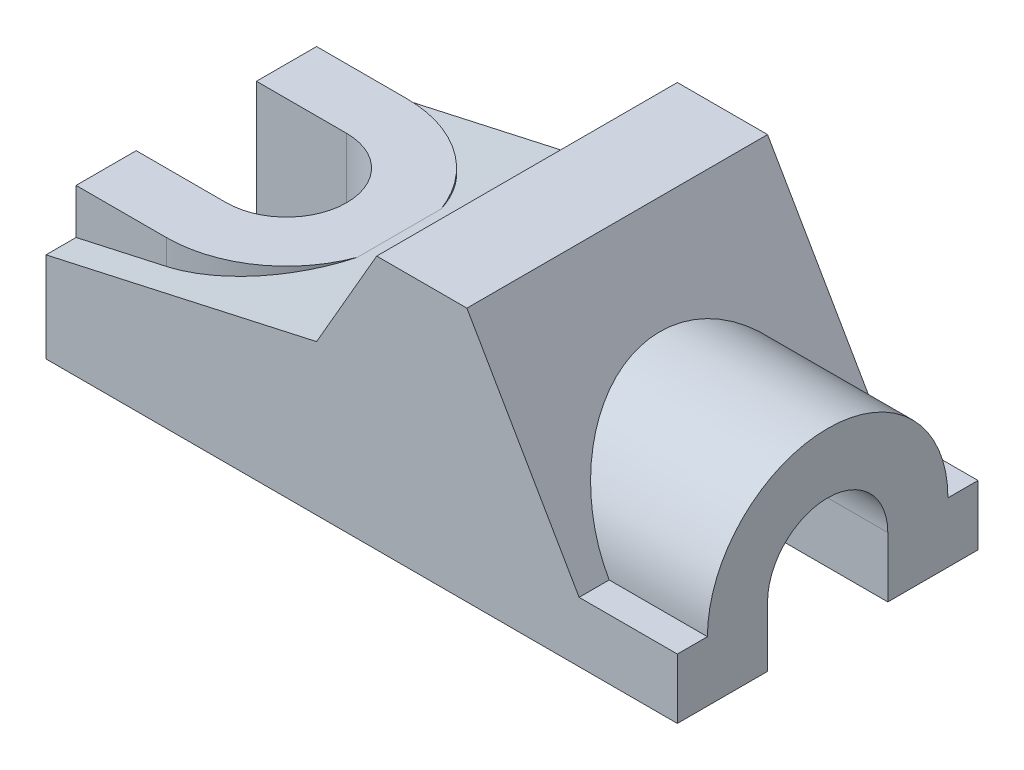
ISO-10303-21;
HEADER;
FILE_DESCRIPTION(('STEP AP214'),'2;1');
FILE_NAME('part.step','',(''),(''),'','','');
FILE_SCHEMA(('AUTOMOTIVE_DESIGN { 1 0 10303 214 1 1 1 1 }'));
ENDSEC;
DATA;
#1=APPLICATION_CONTEXT('core data for automotive mechanical design processes');
#2=APPLICATION_PROTOCOL_DEFINITION('international standard','automotive_design',2000,#1);
#3=PRODUCT_CONTEXT('',#1,'mechanical');
#4=PRODUCT('Part','Part','',(#3));
#5=PRODUCT_RELATED_PRODUCT_CATEGORY('part','',(#4));
#6=PRODUCT_DEFINITION_FORMATION('','',#4);
#7=PRODUCT_DEFINITION_CONTEXT('part definition',#1,'design');
#8=PRODUCT_DEFINITION('design','',#6,#7);
#9=PRODUCT_DEFINITION_SHAPE('','',#8);
#10=(LENGTH_UNIT() NAMED_UNIT(*) SI_UNIT(.MILLI.,.METRE.));
#11=(NAMED_UNIT(*) PLANE_ANGLE_UNIT() SI_UNIT($,.RADIAN.));
#12=(NAMED_UNIT(*) SI_UNIT($,.STERADIAN.) SOLID_ANGLE_UNIT());
#13=UNCERTAINTY_MEASURE_WITH_UNIT(LENGTH_MEASURE(1.E-05),#10,'distance_accuracy_value','');
#14=(GEOMETRIC_REPRESENTATION_CONTEXT(3) GLOBAL_UNCERTAINTY_ASSIGNED_CONTEXT((#13)) GLOBAL_UNIT_ASSIGNED_CONTEXT((#10,
#11,#12)) REPRESENTATION_CONTEXT('',''));
#15=CARTESIAN_POINT('',(0.,0.,0.));
#16=DIRECTION('',(0.,0.,1.));
#17=DIRECTION('',(1.,0.,0.));
#18=AXIS2_PLACEMENT_3D('',#15,#16,#17);
#19=CARTESIAN_POINT('',(0.,0.,31.75));
#20=DIRECTION('',(1.,0.,0.));
#21=DIRECTION('',(0.,0.,-1.));
#22=AXIS2_PLACEMENT_3D('',#19,#20,#21);
#23=PLANE('',#22);
#24=DIRECTION('',(0.,1.,0.));
#25=VECTOR('',#24,1.);
#26=CARTESIAN_POINT('',(0.,-44.3358461285371,12.7));
#27=LINE('',#26,#25);
#28=CARTESIAN_POINT('',(0.,0.,12.7));
#29=VERTEX_POINT('',#28);
#30=CARTESIAN_POINT('',(0.,28.575,12.7));
#31=VERTEX_POINT('',#30);
#32=EDGE_CURVE('E201',#29,#31,#27,.T.);
#33=ORIENTED_EDGE('',*,*,#32,.F.);
#34=DIRECTION('',(0.,0.,-1.));
#35=VECTOR('',#34,1.);
#36=CARTESIAN_POINT('',(0.,0.,31.75));
#37=LINE('',#36,#35);
#38=CARTESIAN_POINT('',(0.,0.,31.75));
#39=VERTEX_POINT('',#38);
#40=EDGE_CURVE('E11',#39,#29,#37,.T.);
#41=ORIENTED_EDGE('',*,*,#40,.F.);
#42=DIRECTION('',(0.,-1.,0.));
#43=VECTOR('',#42,1.);
#44=CARTESIAN_POINT('',(0.,0.,31.75));
#45=LINE('',#44,#43);
#46=CARTESIAN_POINT('',(0.,19.05,31.75));
#47=VERTEX_POINT('',#46);
#48=EDGE_CURVE('E298',#47,#39,#45,.T.);
#49=ORIENTED_EDGE('',*,*,#48,.F.);
#50=DIRECTION('',(0.,0.,-1.));
#51=VECTOR('',#50,1.);
#52=CARTESIAN_POINT('',(0.,19.05,31.75));
#53=LINE('',#52,#51);
#54=CARTESIAN_POINT('',(0.,19.05,25.4));
#55=VERTEX_POINT('',#54);
#56=EDGE_CURVE('E336',#47,#55,#53,.T.);
#57=ORIENTED_EDGE('',*,*,#56,.T.);
#58=DIRECTION('',(0.,1.,0.));
#59=VECTOR('',#58,1.);
#60=CARTESIAN_POINT('',(0.,-44.3358461285371,25.4));
#61=LINE('',#60,#59);
#62=CARTESIAN_POINT('',(0.,28.575,25.4));
#63=VERTEX_POINT('',#62);
#64=EDGE_CURVE('E229',#55,#63,#61,.T.);
#65=ORIENTED_EDGE('',*,*,#64,.T.);
#66=DIRECTION('',(0.,0.,-1.));
#67=VECTOR('',#66,1.);
#68=CARTESIAN_POINT('',(0.,28.575,0.));
#69=LINE('',#68,#67);
#70=EDGE_CURVE('E225',#63,#31,#69,.T.);
#71=ORIENTED_EDGE('',*,*,#70,.T.);
#72=EDGE_LOOP('',(#33,#41,#49,#57,#65,#71));
#73=FACE_BOUND('',#72,.T.);
#74=ADVANCED_FACE('F35',(#73),#23,.F.);
#75=CARTESIAN_POINT('',(0.,0.,31.75));
#76=DIRECTION('',(0.,1.,0.));
#77=DIRECTION('',(0.,0.,1.));
#78=AXIS2_PLACEMENT_3D('',#75,#76,#77);
#79=PLANE('',#78);
#80=DIRECTION('',(-1.,0.,0.));
#81=VECTOR('',#80,1.);
#82=CARTESIAN_POINT('',(0.,0.,12.7));
#83=LINE('',#82,#81);
#84=CARTESIAN_POINT('',(19.05,0.,12.7));
#85=VERTEX_POINT('',#84);
#86=EDGE_CURVE('E195',#85,#29,#83,.T.);
#87=ORIENTED_EDGE('',*,*,#86,.F.);
#88=CARTESIAN_POINT('',(19.05,0.,0.));
#89=DIRECTION('',(0.,-1.,0.));
#90=DIRECTION('',(0.,0.,-1.));
#91=AXIS2_PLACEMENT_3D('',#88,#89,#90);
#92=CIRCLE('',#91,12.7);
#93=CARTESIAN_POINT('',(19.05,0.,-12.7));
#94=VERTEX_POINT('',#93);
#95=EDGE_CURVE('E205',#94,#85,#92,.T.);
#96=ORIENTED_EDGE('',*,*,#95,.F.);
#97=DIRECTION('',(-1.,0.,0.));
#98=VECTOR('',#97,1.);
#99=CARTESIAN_POINT('',(0.,0.,-12.7));
#100=LINE('',#99,#98);
#101=CARTESIAN_POINT('',(0.,0.,-12.7));
#102=VERTEX_POINT('',#101);
#103=EDGE_CURVE('E212',#94,#102,#100,.T.);
#104=ORIENTED_EDGE('',*,*,#103,.T.);
#105=CARTESIAN_POINT('',(0.,0.,-31.75));
#106=VERTEX_POINT('',#105);
#107=EDGE_CURVE('E43',#102,#106,#37,.T.);
#108=ORIENTED_EDGE('',*,*,#107,.T.);
#109=DIRECTION('',(1.,0.,0.));
#110=VECTOR('',#109,1.);
#111=CARTESIAN_POINT('',(0.,0.,-31.75));
#112=LINE('',#111,#110);
#113=CARTESIAN_POINT('',(133.35,0.,-31.75));
#114=VERTEX_POINT('',#113);
#115=EDGE_CURVE('E319',#106,#114,#112,.T.);
#116=ORIENTED_EDGE('',*,*,#115,.T.);
#117=DIRECTION('',(0.,0.,-1.));
#118=VECTOR('',#117,1.);
#119=CARTESIAN_POINT('',(133.35,0.,31.75));
#120=LINE('',#119,#118);
#121=CARTESIAN_POINT('',(133.35,0.,-12.7));
#122=VERTEX_POINT('',#121);
#123=EDGE_CURVE('E354',#122,#114,#120,.T.);
#124=ORIENTED_EDGE('',*,*,#123,.F.);
#125=DIRECTION('',(1.,0.,0.));
#126=VECTOR('',#125,1.);
#127=CARTESIAN_POINT('',(79.375,0.,-12.7));
#128=LINE('',#127,#126);
#129=CARTESIAN_POINT('',(79.375,0.,-12.7));
#130=VERTEX_POINT('',#129);
#131=EDGE_CURVE('E270',#130,#122,#128,.T.);
#132=ORIENTED_EDGE('',*,*,#131,.F.);
#133=DIRECTION('',(0.,0.,-1.));
#134=VECTOR('',#133,1.);
#135=CARTESIAN_POINT('',(79.375,0.,0.));
#136=LINE('',#135,#134);
#137=CARTESIAN_POINT('',(79.375,0.,12.7));
#138=VERTEX_POINT('',#137);
#139=EDGE_CURVE('E258',#138,#130,#136,.T.);
#140=ORIENTED_EDGE('',*,*,#139,.F.);
#141=DIRECTION('',(1.,0.,0.));
#142=VECTOR('',#141,1.);
#143=CARTESIAN_POINT('',(79.375,0.,12.7));
#144=LINE('',#143,#142);
#145=CARTESIAN_POINT('',(133.35,0.,12.7));
#146=VERTEX_POINT('',#145);
#147=EDGE_CURVE('E274',#138,#146,#144,.T.);
#148=ORIENTED_EDGE('',*,*,#147,.T.);
#149=CARTESIAN_POINT('',(133.35,0.,31.75));
#150=VERTEX_POINT('',#149);
#151=EDGE_CURVE('E355',#150,#146,#120,.T.);
#152=ORIENTED_EDGE('',*,*,#151,.F.);
#153=DIRECTION('',(1.,0.,0.));
#154=VECTOR('',#153,1.);
#155=CARTESIAN_POINT('',(0.,0.,31.75));
#156=LINE('',#155,#154);
#157=EDGE_CURVE('E301',#39,#150,#156,.T.);
#158=ORIENTED_EDGE('',*,*,#157,.F.);
#159=ORIENTED_EDGE('',*,*,#40,.T.);
#160=EDGE_LOOP('',(#87,#96,#104,#108,#116,#124,#132,#140,#148,#152,#158,#159));
#161=FACE_BOUND('',#160,.T.);
#162=ADVANCED_FACE('F210',(#161),#79,.F.);
#163=CARTESIAN_POINT('',(0.,19.05,31.75));
#164=DIRECTION('',(0.216930457818656,-0.976187060183953,0.));
#165=DIRECTION('',(0.976187060183953,0.216930457818656,0.));
#166=AXIS2_PLACEMENT_3D('',#163,#164,#165);
#167=PLANE('',#166);
#168=DIRECTION('',(-0.976187060183953,-0.216930457818656,0.));
#169=VECTOR('',#168,1.);
#170=CARTESIAN_POINT('',(-13.4228850625137,16.0671366527747,25.4));
#171=LINE('',#170,#169);
#172=CARTESIAN_POINT('',(19.05,23.2833333333333,25.4));
#173=VERTEX_POINT('',#172);
#174=EDGE_CURVE('E239',#173,#55,#171,.T.);
#175=ORIENTED_EDGE('',*,*,#174,.T.);
#176=ORIENTED_EDGE('',*,*,#56,.F.);
#177=DIRECTION('',(-0.976187060183953,-0.216930457818656,0.));
#178=VECTOR('',#177,1.);
#179=CARTESIAN_POINT('',(0.,19.05,31.75));
#180=LINE('',#179,#178);
#181=CARTESIAN_POINT('',(57.15,31.75,31.75));
#182=VERTEX_POINT('',#181);
#183=EDGE_CURVE('E314',#182,#47,#180,.T.);
#184=ORIENTED_EDGE('',*,*,#183,.F.);
#185=DIRECTION('',(0.,0.,-1.));
#186=VECTOR('',#185,1.);
#187=CARTESIAN_POINT('',(57.15,31.75,31.75));
#188=LINE('',#187,#186);
#189=CARTESIAN_POINT('',(57.15,31.75,-31.75));
#190=VERTEX_POINT('',#189);
#191=EDGE_CURVE('E339',#182,#190,#188,.T.);
#192=ORIENTED_EDGE('',*,*,#191,.T.);
#193=DIRECTION('',(-0.976187060183953,-0.216930457818656,0.));
#194=VECTOR('',#193,1.);
#195=CARTESIAN_POINT('',(0.,19.05,-31.75));
#196=LINE('',#195,#194);
#197=CARTESIAN_POINT('',(0.,19.05,-31.75));
#198=VERTEX_POINT('',#197);
#199=EDGE_CURVE('E302',#190,#198,#196,.T.);
#200=ORIENTED_EDGE('',*,*,#199,.T.);
#201=CARTESIAN_POINT('',(0.,19.05,-25.4));
#202=VERTEX_POINT('',#201);
#203=EDGE_CURVE('E316',#202,#198,#53,.T.);
#204=ORIENTED_EDGE('',*,*,#203,.F.);
#205=DIRECTION('',(-0.976187060183953,-0.216930457818656,0.));
#206=VECTOR('',#205,1.);
#207=CARTESIAN_POINT('',(-13.4228850625137,16.0671366527747,-25.4));
#208=LINE('',#207,#206);
#209=CARTESIAN_POINT('',(19.05,23.2833333333333,-25.4));
#210=VERTEX_POINT('',#209);
#211=EDGE_CURVE('E240',#210,#202,#208,.T.);
#212=ORIENTED_EDGE('',*,*,#211,.F.);
#213=CARTESIAN_POINT('',(19.05,23.2833333333333,0.));
#214=DIRECTION('',(0.216930457818656,-0.976187060183953,0.));
#215=DIRECTION('',(0.976187060183953,0.216930457818656,0.));
#216=AXIS2_PLACEMENT_3D('',#213,#214,#215);
#217=ELLIPSE('',#216,26.0196032461377,25.4);
#218=CARTESIAN_POINT('',(42.8625,28.575,-8.83882592599273));
#219=VERTEX_POINT('',#218);
#220=EDGE_CURVE('E236',#210,#219,#217,.T.);
#221=ORIENTED_EDGE('',*,*,#220,.T.);
#222=DIRECTION('',(0.,0.,1.));
#223=VECTOR('',#222,1.);
#224=CARTESIAN_POINT('',(42.8625,28.575,0.));
#225=LINE('',#224,#223);
#226=CARTESIAN_POINT('',(42.8625,28.575,8.83882592599273));
#227=VERTEX_POINT('',#226);
#228=EDGE_CURVE('E235',#219,#227,#225,.T.);
#229=ORIENTED_EDGE('',*,*,#228,.T.);
#230=EDGE_CURVE('E214',#227,#173,#217,.T.);
#231=ORIENTED_EDGE('',*,*,#230,.T.);
#232=EDGE_LOOP('',(#175,#176,#184,#192,#200,#204,#212,#221,#229,#231));
#233=FACE_BOUND('',#232,.T.);
#234=ADVANCED_FACE('F423',(#233),#167,.F.);
#235=CARTESIAN_POINT('',(112.598522628063,12.7,31.75));
#236=DIRECTION('',(0.,-1.,0.));
#237=DIRECTION('',(0.,0.,-1.));
#238=AXIS2_PLACEMENT_3D('',#235,#236,#237);
#239=PLANE('',#238);
#240=DIRECTION('',(0.,0.,-1.));
#241=VECTOR('',#240,1.);
#242=CARTESIAN_POINT('',(112.598522628063,12.7,31.75));
#243=LINE('',#242,#241);
#244=CARTESIAN_POINT('',(112.598522628063,12.7,-25.4));
#245=VERTEX_POINT('',#244);
#246=CARTESIAN_POINT('',(112.598522628063,12.7,-31.75));
#247=VERTEX_POINT('',#246);
#248=EDGE_CURVE('E348',#245,#247,#243,.T.);
#249=ORIENTED_EDGE('',*,*,#248,.F.);
#250=DIRECTION('',(1.,0.,0.));
#251=VECTOR('',#250,1.);
#252=CARTESIAN_POINT('',(40.5206063251673,12.7,-25.4));
#253=LINE('',#252,#251);
#254=CARTESIAN_POINT('',(133.35,12.7,-25.4));
#255=VERTEX_POINT('',#254);
#256=EDGE_CURVE('E281',#245,#255,#253,.T.);
#257=ORIENTED_EDGE('',*,*,#256,.T.);
#258=DIRECTION('',(0.,0.,-1.));
#259=VECTOR('',#258,1.);
#260=CARTESIAN_POINT('',(133.35,12.7,31.75));
#261=LINE('',#260,#259);
#262=CARTESIAN_POINT('',(133.35,12.7,-31.75));
#263=VERTEX_POINT('',#262);
#264=EDGE_CURVE('E352',#255,#263,#261,.T.);
#265=ORIENTED_EDGE('',*,*,#264,.T.);
#266=DIRECTION('',(-1.,0.,0.));
#267=VECTOR('',#266,1.);
#268=CARTESIAN_POINT('',(112.598522628063,12.7,-31.75));
#269=LINE('',#268,#267);
#270=EDGE_CURVE('E325',#263,#247,#269,.T.);
#271=ORIENTED_EDGE('',*,*,#270,.T.);
#272=EDGE_LOOP('',(#249,#257,#265,#271));
#273=FACE_BOUND('',#272,.T.);
#274=ADVANCED_FACE('F377',(#273),#239,.F.);
#275=ORIENTED_EDGE('',*,*,#107,.F.);
#276=DIRECTION('',(0.,1.,0.));
#277=VECTOR('',#276,1.);
#278=CARTESIAN_POINT('',(0.,-44.3358461285371,-12.7));
#279=LINE('',#278,#277);
#280=CARTESIAN_POINT('',(0.,28.575,-12.7));
#281=VERTEX_POINT('',#280);
#282=EDGE_CURVE('E50',#102,#281,#279,.T.);
#283=ORIENTED_EDGE('',*,*,#282,.T.);
#284=DIRECTION('',(0.,0.,1.));
#285=VECTOR('',#284,1.);
#286=CARTESIAN_POINT('',(0.,28.575,0.));
#287=LINE('',#286,#285);
#288=CARTESIAN_POINT('',(0.,28.575,-25.4));
#289=VERTEX_POINT('',#288);
#290=EDGE_CURVE('E217',#289,#281,#287,.T.);
#291=ORIENTED_EDGE('',*,*,#290,.F.);
#292=DIRECTION('',(0.,1.,0.));
#293=VECTOR('',#292,1.);
#294=CARTESIAN_POINT('',(0.,-44.3358461285371,-25.4));
#295=LINE('',#294,#293);
#296=EDGE_CURVE('E242',#202,#289,#295,.T.);
#297=ORIENTED_EDGE('',*,*,#296,.F.);
#298=ORIENTED_EDGE('',*,*,#203,.T.);
#299=DIRECTION('',(0.,-1.,0.));
#300=VECTOR('',#299,1.);
#301=CARTESIAN_POINT('',(0.,0.,-31.75));
#302=LINE('',#301,#300);
#303=EDGE_CURVE('E285',#198,#106,#302,.T.);
#304=ORIENTED_EDGE('',*,*,#303,.T.);
#305=EDGE_LOOP('',(#275,#283,#291,#297,#298,#304));
#306=FACE_BOUND('',#305,.T.);
#307=ADVANCED_FACE('F37',(#306),#23,.F.);
#308=CARTESIAN_POINT('',(133.35,12.7,31.75));
#309=DIRECTION('',(-1.,0.,0.));
#310=DIRECTION('',(0.,0.,1.));
#311=AXIS2_PLACEMENT_3D('',#308,#309,#310);
#312=PLANE('',#311);
#313=ORIENTED_EDGE('',*,*,#151,.T.);
#314=DIRECTION('',(0.,-1.,0.));
#315=VECTOR('',#314,1.);
#316=CARTESIAN_POINT('',(133.35,0.,12.7));
#317=LINE('',#316,#315);
#318=CARTESIAN_POINT('',(133.35,12.7,12.7));
#319=VERTEX_POINT('',#318);
#320=EDGE_CURVE('E262',#319,#146,#317,.T.);
#321=ORIENTED_EDGE('',*,*,#320,.F.);
#322=CARTESIAN_POINT('',(133.35,12.7,0.));
#323=DIRECTION('',(1.,0.,0.));
#324=DIRECTION('',(0.,0.,-1.));
#325=AXIS2_PLACEMENT_3D('',#322,#323,#324);
#326=CIRCLE('',#325,12.7);
#327=CARTESIAN_POINT('',(133.35,12.7,-12.7));
#328=VERTEX_POINT('',#327);
#329=EDGE_CURVE('E282',#328,#319,#326,.T.);
#330=ORIENTED_EDGE('',*,*,#329,.F.);
#331=DIRECTION('',(0.,-1.,0.));
#332=VECTOR('',#331,1.);
#333=CARTESIAN_POINT('',(133.35,0.,-12.7));
#334=LINE('',#333,#332);
#335=EDGE_CURVE('E256',#328,#122,#334,.T.);
#336=ORIENTED_EDGE('',*,*,#335,.T.);
#337=ORIENTED_EDGE('',*,*,#123,.T.);
#338=DIRECTION('',(0.,1.,0.));
#339=VECTOR('',#338,1.);
#340=CARTESIAN_POINT('',(133.35,12.7,-31.75));
#341=LINE('',#340,#339);
#342=EDGE_CURVE('E322',#114,#263,#341,.T.);
#343=ORIENTED_EDGE('',*,*,#342,.T.);
#344=ORIENTED_EDGE('',*,*,#264,.F.);
#345=CARTESIAN_POINT('',(133.35,12.7,0.));
#346=DIRECTION('',(1.,0.,0.));
#347=DIRECTION('',(0.,0.,-1.));
#348=AXIS2_PLACEMENT_3D('',#345,#346,#347);
#349=CIRCLE('',#348,25.4);
#350=CARTESIAN_POINT('',(133.35,12.7,25.4));
#351=VERTEX_POINT('',#350);
#352=EDGE_CURVE('E277',#255,#351,#349,.T.);
#353=ORIENTED_EDGE('',*,*,#352,.T.);
#354=CARTESIAN_POINT('',(133.35,12.7,31.75));
#355=VERTEX_POINT('',#354);
#356=EDGE_CURVE('E353',#355,#351,#261,.T.);
#357=ORIENTED_EDGE('',*,*,#356,.F.);
#358=DIRECTION('',(0.,1.,0.));
#359=VECTOR('',#358,1.);
#360=CARTESIAN_POINT('',(133.35,12.7,31.75));
#361=LINE('',#360,#359);
#362=EDGE_CURVE('E304',#150,#355,#361,.T.);
#363=ORIENTED_EDGE('',*,*,#362,.F.);
#364=EDGE_LOOP('',(#313,#321,#330,#336,#337,#343,#344,#353,#357,#363));
#365=FACE_BOUND('',#364,.T.);
#366=ADVANCED_FACE('F362',(#365),#312,.F.);
#367=ORIENTED_EDGE('',*,*,#356,.T.);
#368=DIRECTION('',(1.,0.,0.));
#369=VECTOR('',#368,1.);
#370=CARTESIAN_POINT('',(40.5206063251673,12.7,25.4));
#371=LINE('',#370,#369);
#372=CARTESIAN_POINT('',(112.598522628063,12.7,25.4));
#373=VERTEX_POINT('',#372);
#374=EDGE_CURVE('E290',#373,#351,#371,.T.);
#375=ORIENTED_EDGE('',*,*,#374,.F.);
#376=CARTESIAN_POINT('',(112.598522628063,12.7,31.75));
#377=VERTEX_POINT('',#376);
#378=EDGE_CURVE('E349',#377,#373,#243,.T.);
#379=ORIENTED_EDGE('',*,*,#378,.F.);
#380=DIRECTION('',(-1.,0.,0.));
#381=VECTOR('',#380,1.);
#382=CARTESIAN_POINT('',(112.598522628063,12.7,31.75));
#383=LINE('',#382,#381);
#384=EDGE_CURVE('E306',#355,#377,#383,.T.);
#385=ORIENTED_EDGE('',*,*,#384,.F.);
#386=EDGE_LOOP('',(#367,#375,#379,#385));
#387=FACE_BOUND('',#386,.T.);
#388=ADVANCED_FACE('F385',(#387),#239,.F.);
#389=CARTESIAN_POINT('',(88.9,53.7470452561251,31.75));
#390=DIRECTION('',(-0.866025403784436,-0.500000000000004,0.));
#391=DIRECTION('',(0.500000000000004,-0.866025403784436,0.));
#392=AXIS2_PLACEMENT_3D('',#389,#390,#391);
#393=PLANE('',#392);
#394=ORIENTED_EDGE('',*,*,#378,.T.);
#395=CARTESIAN_POINT('',(112.598522628063,12.7,0.));
#396=DIRECTION('',(-0.866025403784436,-0.500000000000004,0.));
#397=DIRECTION('',(0.500000000000004,-0.866025403784436,0.));
#398=AXIS2_PLACEMENT_3D('',#395,#396,#397);
#399=ELLIPSE('',#398,29.3293936748331,25.4);
#400=EDGE_CURVE('E287',#245,#373,#399,.F.);
#401=ORIENTED_EDGE('',*,*,#400,.F.);
#402=ORIENTED_EDGE('',*,*,#248,.T.);
#403=DIRECTION('',(-0.500000000000004,0.866025403784436,0.));
#404=VECTOR('',#403,1.);
#405=CARTESIAN_POINT('',(88.9,53.7470452561251,-31.75));
#406=LINE('',#405,#404);
#407=CARTESIAN_POINT('',(88.9,53.7470452561251,-31.75));
#408=VERTEX_POINT('',#407);
#409=EDGE_CURVE('E328',#247,#408,#406,.T.);
#410=ORIENTED_EDGE('',*,*,#409,.T.);
#411=DIRECTION('',(0.,0.,-1.));
#412=VECTOR('',#411,1.);
#413=CARTESIAN_POINT('',(88.9,53.7470452561251,31.75));
#414=LINE('',#413,#412);
#415=CARTESIAN_POINT('',(88.9,53.7470452561251,31.75));
#416=VERTEX_POINT('',#415);
#417=EDGE_CURVE('E345',#416,#408,#414,.T.);
#418=ORIENTED_EDGE('',*,*,#417,.F.);
#419=DIRECTION('',(-0.500000000000004,0.866025403784436,0.));
#420=VECTOR('',#419,1.);
#421=CARTESIAN_POINT('',(88.9,53.7470452561251,31.75));
#422=LINE('',#421,#420);
#423=EDGE_CURVE('E308',#377,#416,#422,.T.);
#424=ORIENTED_EDGE('',*,*,#423,.F.);
#425=EDGE_LOOP('',(#394,#401,#402,#410,#418,#424));
#426=FACE_BOUND('',#425,.T.);
#427=ADVANCED_FACE('F389',(#426),#393,.F.);
#428=CARTESIAN_POINT('',(69.8500000000008,53.7470452561246,31.75));
#429=DIRECTION('',(0.,-1.,0.));
#430=DIRECTION('',(1.,0.,0.));
#431=AXIS2_PLACEMENT_3D('',#428,#429,#430);
#432=PLANE('',#431);
#433=DIRECTION('',(-1.,0.,0.));
#434=VECTOR('',#433,1.);
#435=CARTESIAN_POINT('',(69.8500000000008,53.7470452561246,-31.75));
#436=LINE('',#435,#434);
#437=CARTESIAN_POINT('',(69.8500000000008,53.7470452561246,-31.75));
#438=VERTEX_POINT('',#437);
#439=EDGE_CURVE('E330',#408,#438,#436,.T.);
#440=ORIENTED_EDGE('',*,*,#439,.T.);
#441=DIRECTION('',(0.,0.,-1.));
#442=VECTOR('',#441,1.);
#443=CARTESIAN_POINT('',(69.8500000000008,53.7470452561246,31.75));
#444=LINE('',#443,#442);
#445=CARTESIAN_POINT('',(69.8500000000008,53.7470452561246,31.75));
#446=VERTEX_POINT('',#445);
#447=EDGE_CURVE('E342',#446,#438,#444,.T.);
#448=ORIENTED_EDGE('',*,*,#447,.F.);
#449=DIRECTION('',(-1.,0.,0.));
#450=VECTOR('',#449,1.);
#451=CARTESIAN_POINT('',(69.8500000000008,53.7470452561246,31.75));
#452=LINE('',#451,#450);
#453=EDGE_CURVE('E310',#416,#446,#452,.T.);
#454=ORIENTED_EDGE('',*,*,#453,.F.);
#455=ORIENTED_EDGE('',*,*,#417,.T.);
#456=EDGE_LOOP('',(#440,#448,#454,#455));
#457=FACE_BOUND('',#456,.T.);
#458=ADVANCED_FACE('F446',(#457),#432,.F.);
#459=CARTESIAN_POINT('',(57.15,31.75,31.75));
#460=DIRECTION('',(0.866025403784423,-0.500000000000027,0.));
#461=DIRECTION('',(0.500000000000027,0.866025403784423,0.));
#462=AXIS2_PLACEMENT_3D('',#459,#460,#461);
#463=PLANE('',#462);
#464=DIRECTION('',(-0.500000000000027,-0.866025403784423,0.));
#465=VECTOR('',#464,1.);
#466=CARTESIAN_POINT('',(57.15,31.75,-31.75));
#467=LINE('',#466,#465);
#468=EDGE_CURVE('E332',#438,#190,#467,.T.);
#469=ORIENTED_EDGE('',*,*,#468,.T.);
#470=ORIENTED_EDGE('',*,*,#191,.F.);
#471=DIRECTION('',(-0.500000000000027,-0.866025403784423,0.));
#472=VECTOR('',#471,1.);
#473=CARTESIAN_POINT('',(57.15,31.75,31.75));
#474=LINE('',#473,#472);
#475=EDGE_CURVE('E312',#446,#182,#474,.T.);
#476=ORIENTED_EDGE('',*,*,#475,.F.);
#477=ORIENTED_EDGE('',*,*,#447,.T.);
#478=EDGE_LOOP('',(#469,#470,#476,#477));
#479=FACE_BOUND('',#478,.T.);
#480=ADVANCED_FACE('F444',(#479),#463,.F.);
#481=CARTESIAN_POINT('',(0.,0.,31.75));
#482=DIRECTION('',(0.,0.,-1.));
#483=DIRECTION('',(-1.,0.,0.));
#484=AXIS2_PLACEMENT_3D('',#481,#482,#483);
#485=PLANE('',#484);
#486=ORIENTED_EDGE('',*,*,#48,.T.);
#487=ORIENTED_EDGE('',*,*,#157,.T.);
#488=ORIENTED_EDGE('',*,*,#362,.T.);
#489=ORIENTED_EDGE('',*,*,#384,.T.);
#490=ORIENTED_EDGE('',*,*,#423,.T.);
#491=ORIENTED_EDGE('',*,*,#453,.T.);
#492=ORIENTED_EDGE('',*,*,#475,.T.);
#493=ORIENTED_EDGE('',*,*,#183,.T.);
#494=EDGE_LOOP('',(#486,#487,#488,#489,#490,#491,#492,#493));
#495=FACE_BOUND('',#494,.T.);
#496=ADVANCED_FACE('F393',(#495),#485,.F.);
#497=CARTESIAN_POINT('',(0.,0.,-31.75));
#498=DIRECTION('',(0.,0.,-1.));
#499=DIRECTION('',(-1.,0.,0.));
#500=AXIS2_PLACEMENT_3D('',#497,#498,#499);
#501=PLANE('',#500);
#502=ORIENTED_EDGE('',*,*,#303,.F.);
#503=ORIENTED_EDGE('',*,*,#199,.F.);
#504=ORIENTED_EDGE('',*,*,#468,.F.);
#505=ORIENTED_EDGE('',*,*,#439,.F.);
#506=ORIENTED_EDGE('',*,*,#409,.F.);
#507=ORIENTED_EDGE('',*,*,#270,.F.);
#508=ORIENTED_EDGE('',*,*,#342,.F.);
#509=ORIENTED_EDGE('',*,*,#115,.F.);
#510=EDGE_LOOP('',(#502,#503,#504,#505,#506,#507,#508,#509));
#511=FACE_BOUND('',#510,.T.);
#512=ADVANCED_FACE('F372',(#511),#501,.T.);
#513=CARTESIAN_POINT('',(40.5206063251673,12.7,0.));
#514=DIRECTION('',(1.,0.,0.));
#515=DIRECTION('',(0.,0.,-1.));
#516=AXIS2_PLACEMENT_3D('',#513,#514,#515);
#517=CYLINDRICAL_SURFACE('',#516,25.4);
#518=ORIENTED_EDGE('',*,*,#256,.F.);
#519=ORIENTED_EDGE('',*,*,#400,.T.);
#520=ORIENTED_EDGE('',*,*,#374,.T.);
#521=ORIENTED_EDGE('',*,*,#352,.F.);
#522=EDGE_LOOP('',(#518,#519,#520,#521));
#523=FACE_BOUND('',#522,.T.);
#524=ADVANCED_FACE('F382',(#523),#517,.T.);
#525=CARTESIAN_POINT('',(40.5206063251673,12.7,0.));
#526=DIRECTION('',(1.,0.,0.));
#527=DIRECTION('',(0.,0.,-1.));
#528=AXIS2_PLACEMENT_3D('',#525,#526,#527);
#529=CYLINDRICAL_SURFACE('',#528,12.7);
#530=DIRECTION('',(1.,0.,0.));
#531=VECTOR('',#530,1.);
#532=CARTESIAN_POINT('',(40.5206063251673,12.7,12.7));
#533=LINE('',#532,#531);
#534=CARTESIAN_POINT('',(79.375,12.7,12.7));
#535=VERTEX_POINT('',#534);
#536=EDGE_CURVE('E291',#535,#319,#533,.T.);
#537=ORIENTED_EDGE('',*,*,#536,.F.);
#538=CARTESIAN_POINT('',(79.375,12.7,0.));
#539=DIRECTION('',(1.,0.,0.));
#540=DIRECTION('',(0.,0.,-1.));
#541=AXIS2_PLACEMENT_3D('',#538,#539,#540);
#542=CIRCLE('',#541,12.7);
#543=CARTESIAN_POINT('',(79.375,12.7,-12.7));
#544=VERTEX_POINT('',#543);
#545=EDGE_CURVE('E264',#544,#535,#542,.T.);
#546=ORIENTED_EDGE('',*,*,#545,.F.);
#547=DIRECTION('',(1.,0.,0.));
#548=VECTOR('',#547,1.);
#549=CARTESIAN_POINT('',(40.5206063251673,12.7,-12.7));
#550=LINE('',#549,#548);
#551=EDGE_CURVE('E286',#544,#328,#550,.T.);
#552=ORIENTED_EDGE('',*,*,#551,.T.);
#553=ORIENTED_EDGE('',*,*,#329,.T.);
#554=EDGE_LOOP('',(#537,#546,#552,#553));
#555=FACE_BOUND('',#554,.T.);
#556=ADVANCED_FACE('F405',(#555),#529,.F.);
#557=CARTESIAN_POINT('',(79.375,0.,12.7));
#558=DIRECTION('',(0.,0.,1.));
#559=DIRECTION('',(1.,0.,0.));
#560=AXIS2_PLACEMENT_3D('',#557,#558,#559);
#561=PLANE('',#560);
#562=ORIENTED_EDGE('',*,*,#320,.T.);
#563=ORIENTED_EDGE('',*,*,#147,.F.);
#564=DIRECTION('',(0.,-1.,0.));
#565=VECTOR('',#564,1.);
#566=CARTESIAN_POINT('',(79.375,0.,12.7));
#567=LINE('',#566,#565);
#568=EDGE_CURVE('E267',#535,#138,#567,.T.);
#569=ORIENTED_EDGE('',*,*,#568,.F.);
#570=ORIENTED_EDGE('',*,*,#536,.T.);
#571=EDGE_LOOP('',(#562,#563,#569,#570));
#572=FACE_BOUND('',#571,.T.);
#573=ADVANCED_FACE('F399',(#572),#561,.F.);
#574=CARTESIAN_POINT('',(79.375,0.,-12.7));
#575=DIRECTION('',(0.,0.,1.));
#576=DIRECTION('',(0.,-1.,0.));
#577=AXIS2_PLACEMENT_3D('',#574,#575,#576);
#578=PLANE('',#577);
#579=ORIENTED_EDGE('',*,*,#335,.F.);
#580=ORIENTED_EDGE('',*,*,#551,.F.);
#581=DIRECTION('',(0.,-1.,0.));
#582=VECTOR('',#581,1.);
#583=CARTESIAN_POINT('',(79.375,0.,-12.7));
#584=LINE('',#583,#582);
#585=EDGE_CURVE('E261',#544,#130,#584,.T.);
#586=ORIENTED_EDGE('',*,*,#585,.T.);
#587=ORIENTED_EDGE('',*,*,#131,.T.);
#588=EDGE_LOOP('',(#579,#580,#586,#587));
#589=FACE_BOUND('',#588,.T.);
#590=ADVANCED_FACE('F407',(#589),#578,.T.);
#591=CARTESIAN_POINT('',(79.375,0.,0.));
#592=DIRECTION('',(1.,0.,0.));
#593=DIRECTION('',(0.,0.,-1.));
#594=AXIS2_PLACEMENT_3D('',#591,#592,#593);
#595=PLANE('',#594);
#596=ORIENTED_EDGE('',*,*,#139,.T.);
#597=ORIENTED_EDGE('',*,*,#585,.F.);
#598=ORIENTED_EDGE('',*,*,#545,.T.);
#599=ORIENTED_EDGE('',*,*,#568,.T.);
#600=EDGE_LOOP('',(#596,#597,#598,#599));
#601=FACE_BOUND('',#600,.T.);
#602=ADVANCED_FACE('F401',(#601),#595,.T.);
#603=CARTESIAN_POINT('',(0.,28.575,0.));
#604=DIRECTION('',(0.,-1.,0.));
#605=DIRECTION('',(0.,0.,-1.));
#606=AXIS2_PLACEMENT_3D('',#603,#604,#605);
#607=PLANE('',#606);
#608=ORIENTED_EDGE('',*,*,#228,.F.);
#609=CARTESIAN_POINT('',(19.05,28.575,0.));
#610=DIRECTION('',(0.,-1.,0.));
#611=DIRECTION('',(0.,0.,-1.));
#612=AXIS2_PLACEMENT_3D('',#609,#610,#611);
#613=CIRCLE('',#612,25.4);
#614=CARTESIAN_POINT('',(19.05,28.575,-25.4));
#615=VERTEX_POINT('',#614);
#616=EDGE_CURVE('E249',#615,#219,#613,.T.);
#617=ORIENTED_EDGE('',*,*,#616,.F.);
#618=DIRECTION('',(-1.,0.,0.));
#619=VECTOR('',#618,1.);
#620=CARTESIAN_POINT('',(0.,28.575,-25.4));
#621=LINE('',#620,#619);
#622=EDGE_CURVE('E221',#615,#289,#621,.T.);
#623=ORIENTED_EDGE('',*,*,#622,.T.);
#624=ORIENTED_EDGE('',*,*,#290,.T.);
#625=DIRECTION('',(-1.,0.,0.));
#626=VECTOR('',#625,1.);
#627=CARTESIAN_POINT('',(0.,28.575,-12.7));
#628=LINE('',#627,#626);
#629=CARTESIAN_POINT('',(19.05,28.575,-12.7));
#630=VERTEX_POINT('',#629);
#631=EDGE_CURVE('E202',#630,#281,#628,.T.);
#632=ORIENTED_EDGE('',*,*,#631,.F.);
#633=CARTESIAN_POINT('',(19.05,28.575,0.));
#634=DIRECTION('',(0.,-1.,0.));
#635=DIRECTION('',(0.,0.,-1.));
#636=AXIS2_PLACEMENT_3D('',#633,#634,#635);
#637=CIRCLE('',#636,12.7);
#638=CARTESIAN_POINT('',(19.05,28.575,12.7));
#639=VERTEX_POINT('',#638);
#640=EDGE_CURVE('E220',#630,#639,#637,.T.);
#641=ORIENTED_EDGE('',*,*,#640,.T.);
#642=DIRECTION('',(-1.,0.,0.));
#643=VECTOR('',#642,1.);
#644=CARTESIAN_POINT('',(0.,28.575,12.7));
#645=LINE('',#644,#643);
#646=EDGE_CURVE('E197',#639,#31,#645,.T.);
#647=ORIENTED_EDGE('',*,*,#646,.T.);
#648=ORIENTED_EDGE('',*,*,#70,.F.);
#649=DIRECTION('',(-1.,0.,0.));
#650=VECTOR('',#649,1.);
#651=CARTESIAN_POINT('',(0.,28.575,25.4));
#652=LINE('',#651,#650);
#653=CARTESIAN_POINT('',(19.05,28.575,25.4));
#654=VERTEX_POINT('',#653);
#655=EDGE_CURVE('E230',#654,#63,#652,.T.);
#656=ORIENTED_EDGE('',*,*,#655,.F.);
#657=EDGE_CURVE('E243',#227,#654,#613,.T.);
#658=ORIENTED_EDGE('',*,*,#657,.F.);
#659=EDGE_LOOP('',(#608,#617,#623,#624,#632,#641,#647,#648,#656,#658));
#660=FACE_BOUND('',#659,.T.);
#661=ADVANCED_FACE('F414',(#660),#607,.F.);
#662=CARTESIAN_POINT('',(0.,-44.3358461285371,-12.7));
#663=DIRECTION('',(0.,0.,-1.));
#664=DIRECTION('',(-1.,0.,0.));
#665=AXIS2_PLACEMENT_3D('',#662,#663,#664);
#666=PLANE('',#665);
#667=ORIENTED_EDGE('',*,*,#282,.F.);
#668=ORIENTED_EDGE('',*,*,#103,.F.);
#669=DIRECTION('',(0.,1.,0.));
#670=VECTOR('',#669,1.);
#671=CARTESIAN_POINT('',(19.05,-44.3358461285371,-12.7));
#672=LINE('',#671,#670);
#673=EDGE_CURVE('E207',#94,#630,#672,.T.);
#674=ORIENTED_EDGE('',*,*,#673,.T.);
#675=ORIENTED_EDGE('',*,*,#631,.T.);
#676=EDGE_LOOP('',(#667,#668,#674,#675));
#677=FACE_BOUND('',#676,.T.);
#678=ADVANCED_FACE('F524',(#677),#666,.F.);
#679=CARTESIAN_POINT('',(19.05,-44.3358461285371,0.));
#680=DIRECTION('',(0.,1.,0.));
#681=DIRECTION('',(0.,0.,1.));
#682=AXIS2_PLACEMENT_3D('',#679,#680,#681);
#683=CYLINDRICAL_SURFACE('',#682,12.7);
#684=ORIENTED_EDGE('',*,*,#673,.F.);
#685=ORIENTED_EDGE('',*,*,#95,.T.);
#686=DIRECTION('',(0.,1.,0.));
#687=VECTOR('',#686,1.);
#688=CARTESIAN_POINT('',(19.05,-44.3358461285371,12.7));
#689=LINE('',#688,#687);
#690=EDGE_CURVE('E191',#85,#639,#689,.T.);
#691=ORIENTED_EDGE('',*,*,#690,.T.);
#692=ORIENTED_EDGE('',*,*,#640,.F.);
#693=EDGE_LOOP('',(#684,#685,#691,#692));
#694=FACE_BOUND('',#693,.T.);
#695=ADVANCED_FACE('F206',(#694),#683,.F.);
#696=CARTESIAN_POINT('',(0.,-44.3358461285371,12.7));
#697=DIRECTION('',(0.,0.,-1.));
#698=DIRECTION('',(-1.,0.,0.));
#699=AXIS2_PLACEMENT_3D('',#696,#697,#698);
#700=PLANE('',#699);
#701=ORIENTED_EDGE('',*,*,#690,.F.);
#702=ORIENTED_EDGE('',*,*,#86,.T.);
#703=ORIENTED_EDGE('',*,*,#32,.T.);
#704=ORIENTED_EDGE('',*,*,#646,.F.);
#705=EDGE_LOOP('',(#701,#702,#703,#704));
#706=FACE_BOUND('',#705,.T.);
#707=ADVANCED_FACE('F193',(#706),#700,.T.);
#708=CARTESIAN_POINT('',(0.,-44.3358461285371,25.4));
#709=DIRECTION('',(0.,0.,-1.));
#710=DIRECTION('',(-1.,0.,0.));
#711=AXIS2_PLACEMENT_3D('',#708,#709,#710);
#712=PLANE('',#711);
#713=ORIENTED_EDGE('',*,*,#174,.F.);
#714=DIRECTION('',(0.,1.,0.));
#715=VECTOR('',#714,1.);
#716=CARTESIAN_POINT('',(19.05,-44.3358461285371,25.4));
#717=LINE('',#716,#715);
#718=EDGE_CURVE('E228',#173,#654,#717,.T.);
#719=ORIENTED_EDGE('',*,*,#718,.T.);
#720=ORIENTED_EDGE('',*,*,#655,.T.);
#721=ORIENTED_EDGE('',*,*,#64,.F.);
#722=EDGE_LOOP('',(#713,#719,#720,#721));
#723=FACE_BOUND('',#722,.T.);
#724=ADVANCED_FACE('F533',(#723),#712,.F.);
#725=CARTESIAN_POINT('',(19.05,-44.3358461285371,0.));
#726=DIRECTION('',(0.,1.,0.));
#727=DIRECTION('',(0.,0.,1.));
#728=AXIS2_PLACEMENT_3D('',#725,#726,#727);
#729=CYLINDRICAL_SURFACE('',#728,25.4);
#730=ORIENTED_EDGE('',*,*,#220,.F.);
#731=DIRECTION('',(0.,1.,0.));
#732=VECTOR('',#731,1.);
#733=CARTESIAN_POINT('',(19.05,-44.3358461285371,-25.4));
#734=LINE('',#733,#732);
#735=EDGE_CURVE('E58',#210,#615,#734,.T.);
#736=ORIENTED_EDGE('',*,*,#735,.T.);
#737=ORIENTED_EDGE('',*,*,#616,.T.);
#738=EDGE_LOOP('',(#730,#736,#737));
#739=FACE_BOUND('',#738,.T.);
#740=ADVANCED_FACE('F538',(#739),#729,.T.);
#741=ORIENTED_EDGE('',*,*,#230,.F.);
#742=ORIENTED_EDGE('',*,*,#657,.T.);
#743=ORIENTED_EDGE('',*,*,#718,.F.);
#744=EDGE_LOOP('',(#741,#742,#743));
#745=FACE_BOUND('',#744,.T.);
#746=ADVANCED_FACE('F550',(#745),#729,.T.);
#747=CARTESIAN_POINT('',(0.,-44.3358461285371,-25.4));
#748=DIRECTION('',(0.,0.,-1.));
#749=DIRECTION('',(-1.,0.,0.));
#750=AXIS2_PLACEMENT_3D('',#747,#748,#749);
#751=PLANE('',#750);
#752=ORIENTED_EDGE('',*,*,#735,.F.);
#753=ORIENTED_EDGE('',*,*,#211,.T.);
#754=ORIENTED_EDGE('',*,*,#296,.T.);
#755=ORIENTED_EDGE('',*,*,#622,.F.);
#756=EDGE_LOOP('',(#752,#753,#754,#755));
#757=FACE_BOUND('',#756,.T.);
#758=ADVANCED_FACE('F560',(#757),#751,.T.);
#759=CLOSED_SHELL('',(#74,#162,#234,#274,#307,#366,#388,#427,#458,#480,#496,#512,#524,#556,#573,
#590,#602,#661,#678,#695,#707,#724,#740,#746,#758));
#760=MANIFOLD_SOLID_BREP('B2',#759);
#761=ADVANCED_BREP_SHAPE_REPRESENTATION('',(#18,#760),#14);
#762=SHAPE_DEFINITION_REPRESENTATION(#9,#761);
ENDSEC;
END-ISO-10303-21;
